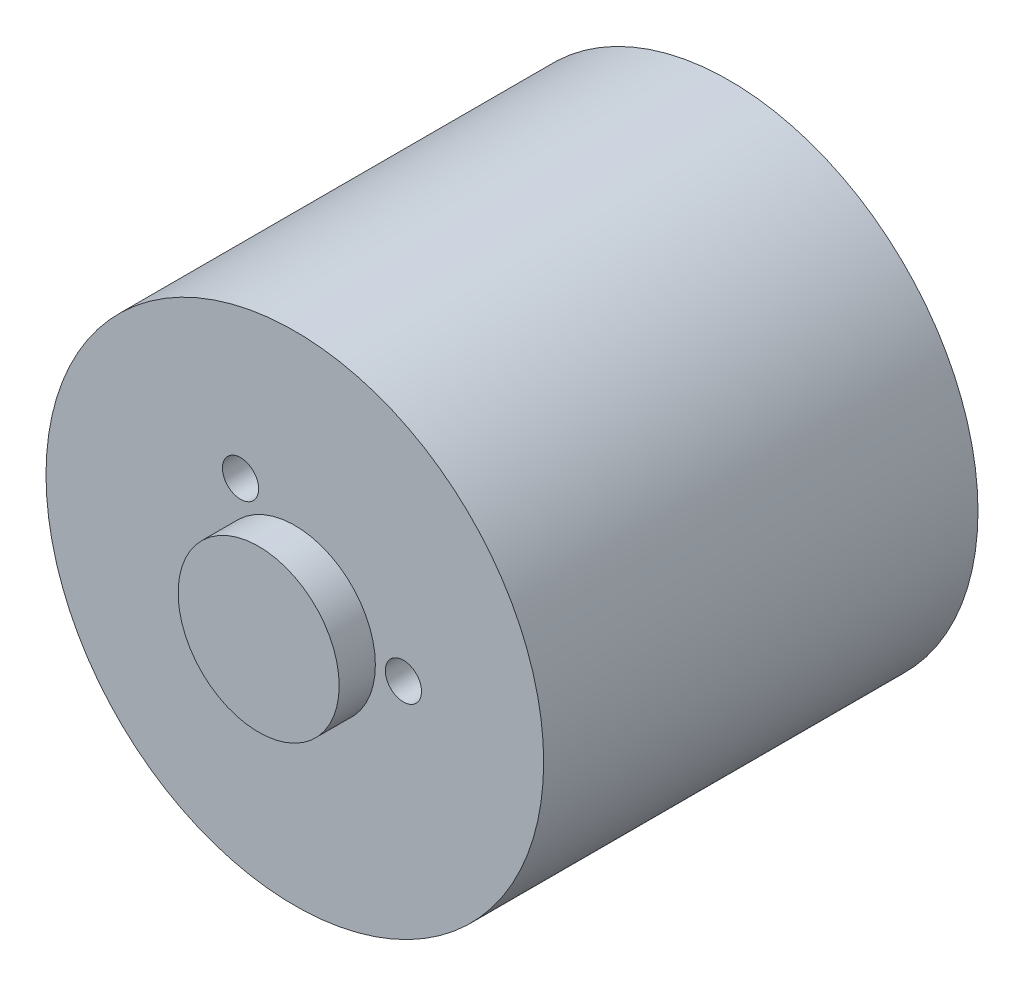
ISO-10303-21;
HEADER;
FILE_DESCRIPTION(('STEP AP214'),'2;1');
FILE_NAME('part.step','',(''),(''),'','','');
FILE_SCHEMA(('AUTOMOTIVE_DESIGN { 1 0 10303 214 1 1 1 1 }'));
ENDSEC;
DATA;
#1=APPLICATION_CONTEXT('core data for automotive mechanical design processes');
#2=APPLICATION_PROTOCOL_DEFINITION('international standard','automotive_design',2000,#1);
#3=PRODUCT_CONTEXT('',#1,'mechanical');
#4=PRODUCT('Part','Part','',(#3));
#5=PRODUCT_RELATED_PRODUCT_CATEGORY('part','',(#4));
#6=PRODUCT_DEFINITION_FORMATION('','',#4);
#7=PRODUCT_DEFINITION_CONTEXT('part definition',#1,'design');
#8=PRODUCT_DEFINITION('design','',#6,#7);
#9=PRODUCT_DEFINITION_SHAPE('','',#8);
#10=(LENGTH_UNIT() NAMED_UNIT(*) SI_UNIT(.MILLI.,.METRE.));
#11=(NAMED_UNIT(*) PLANE_ANGLE_UNIT() SI_UNIT($,.RADIAN.));
#12=(NAMED_UNIT(*) SI_UNIT($,.STERADIAN.) SOLID_ANGLE_UNIT());
#13=UNCERTAINTY_MEASURE_WITH_UNIT(LENGTH_MEASURE(1.E-05),#10,'distance_accuracy_value','');
#14=(GEOMETRIC_REPRESENTATION_CONTEXT(3) GLOBAL_UNCERTAINTY_ASSIGNED_CONTEXT((#13)) GLOBAL_UNIT_ASSIGNED_CONTEXT((#10,
#11,#12)) REPRESENTATION_CONTEXT('',''));
#15=CARTESIAN_POINT('',(0.,0.,0.));
#16=DIRECTION('',(0.,0.,1.));
#17=DIRECTION('',(1.,0.,0.));
#18=AXIS2_PLACEMENT_3D('',#15,#16,#17);
#19=CARTESIAN_POINT('',(0.,0.,24.));
#20=DIRECTION('',(0.,0.,-1.));
#21=DIRECTION('',(-1.,0.,0.));
#22=AXIS2_PLACEMENT_3D('',#19,#20,#21);
#23=CYLINDRICAL_SURFACE('',#22,13.75);
#24=CARTESIAN_POINT('',(0.,0.,24.));
#25=DIRECTION('',(0.,0.,1.));
#26=DIRECTION('',(1.,0.,0.));
#27=AXIS2_PLACEMENT_3D('',#24,#25,#26);
#28=CIRCLE('',#27,13.75);
#29=CARTESIAN_POINT('',(13.75,0.,24.));
#30=VERTEX_POINT('',#29);
#31=EDGE_CURVE('E41',#30,#30,#28,.T.);
#32=ORIENTED_EDGE('',*,*,#31,.F.);
#33=EDGE_LOOP('',(#32));
#34=FACE_BOUND('',#33,.T.);
#35=CARTESIAN_POINT('',(0.,0.,0.));
#36=DIRECTION('',(0.,0.,1.));
#37=DIRECTION('',(1.,0.,0.));
#38=AXIS2_PLACEMENT_3D('',#35,#36,#37);
#39=CIRCLE('',#38,13.75);
#40=CARTESIAN_POINT('',(13.75,0.,0.));
#41=VERTEX_POINT('',#40);
#42=EDGE_CURVE('E46',#41,#41,#39,.T.);
#43=ORIENTED_EDGE('',*,*,#42,.T.);
#44=EDGE_LOOP('',(#43));
#45=FACE_BOUND('',#44,.T.);
#46=ADVANCED_FACE('F34',(#34,#45),#23,.T.);
#47=CARTESIAN_POINT('',(0.,0.,24.));
#48=DIRECTION('',(0.,0.,1.));
#49=DIRECTION('',(1.,0.,0.));
#50=AXIS2_PLACEMENT_3D('',#47,#48,#49);
#51=PLANE('',#50);
#52=CARTESIAN_POINT('',(-3.00000000000002,-5.19615242270662,24.));
#53=DIRECTION('',(0.,0.,1.));
#54=DIRECTION('',(1.,0.,0.));
#55=AXIS2_PLACEMENT_3D('',#52,#53,#54);
#56=CIRCLE('',#55,1.);
#57=CARTESIAN_POINT('',(-2.00000000000002,-5.19615242270662,24.));
#58=VERTEX_POINT('',#57);
#59=EDGE_CURVE('E37',#58,#58,#56,.T.);
#60=ORIENTED_EDGE('',*,*,#59,.F.);
#61=EDGE_LOOP('',(#60));
#62=FACE_BOUND('',#61,.T.);
#63=CARTESIAN_POINT('',(6.,0.,24.));
#64=DIRECTION('',(0.,0.,1.));
#65=DIRECTION('',(1.,0.,0.));
#66=AXIS2_PLACEMENT_3D('',#63,#64,#65);
#67=CIRCLE('',#66,1.);
#68=CARTESIAN_POINT('',(7.,0.,24.));
#69=VERTEX_POINT('',#68);
#70=EDGE_CURVE('E56',#69,#69,#67,.T.);
#71=ORIENTED_EDGE('',*,*,#70,.F.);
#72=EDGE_LOOP('',(#71));
#73=FACE_BOUND('',#72,.T.);
#74=CARTESIAN_POINT('',(-2.99999999999995,5.19615242270666,24.));
#75=DIRECTION('',(0.,0.,1.));
#76=DIRECTION('',(1.,0.,0.));
#77=AXIS2_PLACEMENT_3D('',#74,#75,#76);
#78=CIRCLE('',#77,1.);
#79=CARTESIAN_POINT('',(-1.99999999999995,5.19615242270666,24.));
#80=VERTEX_POINT('',#79);
#81=EDGE_CURVE('E54',#80,#80,#78,.T.);
#82=ORIENTED_EDGE('',*,*,#81,.F.);
#83=EDGE_LOOP('',(#82));
#84=FACE_BOUND('',#83,.T.);
#85=CARTESIAN_POINT('',(0.,0.,24.));
#86=DIRECTION('',(0.,0.,1.));
#87=DIRECTION('',(1.,0.,0.));
#88=AXIS2_PLACEMENT_3D('',#85,#86,#87);
#89=CIRCLE('',#88,4.45);
#90=CARTESIAN_POINT('',(4.45,0.,24.));
#91=VERTEX_POINT('',#90);
#92=EDGE_CURVE('E10',#91,#91,#89,.T.);
#93=ORIENTED_EDGE('',*,*,#92,.F.);
#94=EDGE_LOOP('',(#93));
#95=FACE_BOUND('',#94,.T.);
#96=ORIENTED_EDGE('',*,*,#31,.T.);
#97=EDGE_LOOP('',(#96));
#98=FACE_BOUND('',#97,.T.);
#99=ADVANCED_FACE('F79',(#62,#73,#84,#95,#98),#51,.T.);
#100=CARTESIAN_POINT('',(0.,0.,0.));
#101=DIRECTION('',(0.,0.,1.));
#102=DIRECTION('',(1.,0.,0.));
#103=AXIS2_PLACEMENT_3D('',#100,#101,#102);
#104=PLANE('',#103);
#105=ORIENTED_EDGE('',*,*,#42,.F.);
#106=EDGE_LOOP('',(#105));
#107=FACE_BOUND('',#106,.T.);
#108=ADVANCED_FACE('F71',(#107),#104,.F.);
#109=CARTESIAN_POINT('',(0.,0.,26.));
#110=DIRECTION('',(0.,0.,-1.));
#111=DIRECTION('',(-1.,0.,0.));
#112=AXIS2_PLACEMENT_3D('',#109,#110,#111);
#113=CYLINDRICAL_SURFACE('',#112,4.45);
#114=CARTESIAN_POINT('',(0.,0.,26.));
#115=DIRECTION('',(0.,0.,1.));
#116=DIRECTION('',(1.,0.,0.));
#117=AXIS2_PLACEMENT_3D('',#114,#115,#116);
#118=CIRCLE('',#117,4.45);
#119=CARTESIAN_POINT('',(4.45,0.,26.));
#120=VERTEX_POINT('',#119);
#121=EDGE_CURVE('E49',#120,#120,#118,.T.);
#122=ORIENTED_EDGE('',*,*,#121,.F.);
#123=EDGE_LOOP('',(#122));
#124=FACE_BOUND('',#123,.T.);
#125=ORIENTED_EDGE('',*,*,#92,.T.);
#126=EDGE_LOOP('',(#125));
#127=FACE_BOUND('',#126,.T.);
#128=ADVANCED_FACE('F69',(#124,#127),#113,.T.);
#129=CARTESIAN_POINT('',(0.,0.,26.));
#130=DIRECTION('',(0.,0.,1.));
#131=DIRECTION('',(1.,0.,0.));
#132=AXIS2_PLACEMENT_3D('',#129,#130,#131);
#133=PLANE('',#132);
#134=ORIENTED_EDGE('',*,*,#121,.T.);
#135=EDGE_LOOP('',(#134));
#136=FACE_BOUND('',#135,.T.);
#137=ADVANCED_FACE('F67',(#136),#133,.T.);
#138=CARTESIAN_POINT('',(-2.99999999999995,5.19615242270666,20.));
#139=DIRECTION('',(0.,0.,1.));
#140=DIRECTION('',(1.,0.,0.));
#141=AXIS2_PLACEMENT_3D('',#138,#139,#140);
#142=CYLINDRICAL_SURFACE('',#141,1.);
#143=ORIENTED_EDGE('',*,*,#81,.T.);
#144=EDGE_LOOP('',(#143));
#145=FACE_BOUND('',#144,.T.);
#146=CARTESIAN_POINT('',(-2.99999999999995,5.19615242270666,20.));
#147=DIRECTION('',(0.,0.,1.));
#148=DIRECTION('',(1.,0.,0.));
#149=AXIS2_PLACEMENT_3D('',#146,#147,#148);
#150=CIRCLE('',#149,1.);
#151=CARTESIAN_POINT('',(-1.99999999999995,5.19615242270666,20.));
#152=VERTEX_POINT('',#151);
#153=EDGE_CURVE('E105',#152,#152,#150,.T.);
#154=ORIENTED_EDGE('',*,*,#153,.F.);
#155=EDGE_LOOP('',(#154));
#156=FACE_BOUND('',#155,.T.);
#157=ADVANCED_FACE('F77',(#145,#156),#142,.F.);
#158=CARTESIAN_POINT('',(0.,0.,20.));
#159=DIRECTION('',(0.,0.,1.));
#160=DIRECTION('',(1.,0.,0.));
#161=AXIS2_PLACEMENT_3D('',#158,#159,#160);
#162=PLANE('',#161);
#163=ORIENTED_EDGE('',*,*,#153,.T.);
#164=EDGE_LOOP('',(#163));
#165=FACE_BOUND('',#164,.T.);
#166=ADVANCED_FACE('F101',(#165),#162,.T.);
#167=CARTESIAN_POINT('',(6.,0.,20.));
#168=DIRECTION('',(0.,0.,1.));
#169=DIRECTION('',(1.,0.,0.));
#170=AXIS2_PLACEMENT_3D('',#167,#168,#169);
#171=CYLINDRICAL_SURFACE('',#170,1.);
#172=ORIENTED_EDGE('',*,*,#70,.T.);
#173=EDGE_LOOP('',(#172));
#174=FACE_BOUND('',#173,.T.);
#175=CARTESIAN_POINT('',(6.,0.,20.));
#176=DIRECTION('',(0.,0.,1.));
#177=DIRECTION('',(1.,0.,0.));
#178=AXIS2_PLACEMENT_3D('',#175,#176,#177);
#179=CIRCLE('',#178,1.);
#180=CARTESIAN_POINT('',(7.,0.,20.));
#181=VERTEX_POINT('',#180);
#182=EDGE_CURVE('E107',#181,#181,#179,.T.);
#183=ORIENTED_EDGE('',*,*,#182,.F.);
#184=EDGE_LOOP('',(#183));
#185=FACE_BOUND('',#184,.T.);
#186=ADVANCED_FACE('F125',(#174,#185),#171,.F.);
#187=CARTESIAN_POINT('',(0.,0.,20.));
#188=DIRECTION('',(0.,0.,1.));
#189=DIRECTION('',(1.,0.,0.));
#190=AXIS2_PLACEMENT_3D('',#187,#188,#189);
#191=PLANE('',#190);
#192=ORIENTED_EDGE('',*,*,#182,.T.);
#193=EDGE_LOOP('',(#192));
#194=FACE_BOUND('',#193,.T.);
#195=ADVANCED_FACE('F118',(#194),#191,.T.);
#196=CARTESIAN_POINT('',(-3.00000000000002,-5.19615242270662,20.));
#197=DIRECTION('',(0.,0.,1.));
#198=DIRECTION('',(1.,0.,0.));
#199=AXIS2_PLACEMENT_3D('',#196,#197,#198);
#200=CYLINDRICAL_SURFACE('',#199,1.);
#201=ORIENTED_EDGE('',*,*,#59,.T.);
#202=EDGE_LOOP('',(#201));
#203=FACE_BOUND('',#202,.T.);
#204=CARTESIAN_POINT('',(-3.00000000000002,-5.19615242270662,20.));
#205=DIRECTION('',(0.,0.,1.));
#206=DIRECTION('',(1.,0.,0.));
#207=AXIS2_PLACEMENT_3D('',#204,#205,#206);
#208=CIRCLE('',#207,1.);
#209=CARTESIAN_POINT('',(-2.00000000000002,-5.19615242270662,20.));
#210=VERTEX_POINT('',#209);
#211=EDGE_CURVE('E57',#210,#210,#208,.T.);
#212=ORIENTED_EDGE('',*,*,#211,.F.);
#213=EDGE_LOOP('',(#212));
#214=FACE_BOUND('',#213,.T.);
#215=ADVANCED_FACE('F116',(#203,#214),#200,.F.);
#216=CARTESIAN_POINT('',(0.,0.,20.));
#217=DIRECTION('',(0.,0.,1.));
#218=DIRECTION('',(1.,0.,0.));
#219=AXIS2_PLACEMENT_3D('',#216,#217,#218);
#220=PLANE('',#219);
#221=ORIENTED_EDGE('',*,*,#211,.T.);
#222=EDGE_LOOP('',(#221));
#223=FACE_BOUND('',#222,.T.);
#224=ADVANCED_FACE('F114',(#223),#220,.T.);
#225=CLOSED_SHELL('',(#46,#99,#108,#128,#137,#157,#166,#186,#195,#215,#224));
#226=MANIFOLD_SOLID_BREP('B2',#225);
#227=ADVANCED_BREP_SHAPE_REPRESENTATION('',(#18,#226),#14);
#228=SHAPE_DEFINITION_REPRESENTATION(#9,#227);
ENDSEC;
END-ISO-10303-21;
